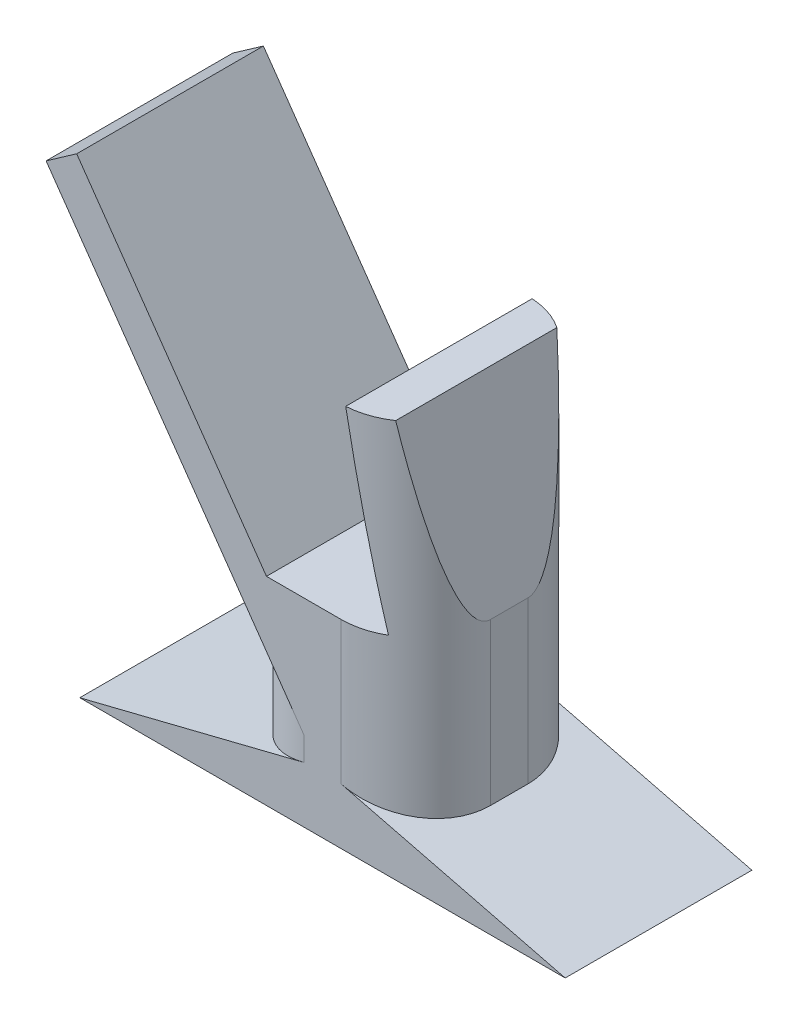
ISO-10303-21;
HEADER;
FILE_DESCRIPTION(('STEP AP214'),'2;1');
FILE_NAME('part.step','',(''),(''),'','','');
FILE_SCHEMA(('AUTOMOTIVE_DESIGN { 1 0 10303 214 1 1 1 1 }'));
ENDSEC;
DATA;
#1=APPLICATION_CONTEXT('core data for automotive mechanical design processes');
#2=APPLICATION_PROTOCOL_DEFINITION('international standard','automotive_design',2000,#1);
#3=PRODUCT_CONTEXT('',#1,'mechanical');
#4=PRODUCT('Part','Part','',(#3));
#5=PRODUCT_RELATED_PRODUCT_CATEGORY('part','',(#4));
#6=PRODUCT_DEFINITION_FORMATION('','',#4);
#7=PRODUCT_DEFINITION_CONTEXT('part definition',#1,'design');
#8=PRODUCT_DEFINITION('design','',#6,#7);
#9=PRODUCT_DEFINITION_SHAPE('','',#8);
#10=(LENGTH_UNIT() NAMED_UNIT(*) SI_UNIT(.MILLI.,.METRE.));
#11=(NAMED_UNIT(*) PLANE_ANGLE_UNIT() SI_UNIT($,.RADIAN.));
#12=(NAMED_UNIT(*) SI_UNIT($,.STERADIAN.) SOLID_ANGLE_UNIT());
#13=UNCERTAINTY_MEASURE_WITH_UNIT(LENGTH_MEASURE(1.E-05),#10,'distance_accuracy_value','');
#14=(GEOMETRIC_REPRESENTATION_CONTEXT(3) GLOBAL_UNCERTAINTY_ASSIGNED_CONTEXT((#13)) GLOBAL_UNIT_ASSIGNED_CONTEXT((#10,
#11,#12)) REPRESENTATION_CONTEXT('',''));
#15=CARTESIAN_POINT('',(0.,0.,0.));
#16=DIRECTION('',(0.,0.,1.));
#17=DIRECTION('',(1.,0.,0.));
#18=AXIS2_PLACEMENT_3D('',#15,#16,#17);
#19=CARTESIAN_POINT('',(0.,2.54,12.7));
#20=DIRECTION('',(-0.242535625036333,-0.970142500145332,0.));
#21=DIRECTION('',(0.970142500145332,-0.242535625036333,0.));
#22=AXIS2_PLACEMENT_3D('',#19,#20,#21);
#23=PLANE('',#22);
#24=DIRECTION('',(-0.970142500145332,0.242535625036333,0.));
#25=VECTOR('',#24,1.);
#26=CARTESIAN_POINT('',(0.,2.54,0.));
#27=LINE('',#26,#25);
#28=CARTESIAN_POINT('',(10.16,0.,0.));
#29=VERTEX_POINT('',#28);
#30=CARTESIAN_POINT('',(-5.08,3.81,0.));
#31=VERTEX_POINT('',#30);
#32=EDGE_CURVE('E222',#29,#31,#27,.T.);
#33=ORIENTED_EDGE('',*,*,#32,.T.);
#34=CARTESIAN_POINT('',(-5.08,3.81,5.08));
#35=DIRECTION('',(-0.242535625036333,-0.970142500145332,0.));
#36=DIRECTION('',(0.970142500145332,-0.242535625036333,0.));
#37=AXIS2_PLACEMENT_3D('',#34,#35,#36);
#38=ELLIPSE('',#37,5.23634414453443,5.08);
#39=CARTESIAN_POINT('',(0.,2.54,5.08));
#40=VERTEX_POINT('',#39);
#41=EDGE_CURVE('E42',#31,#40,#38,.T.);
#42=ORIENTED_EDGE('',*,*,#41,.T.);
#43=DIRECTION('',(0.,0.,-1.));
#44=VECTOR('',#43,1.);
#45=CARTESIAN_POINT('',(0.,2.54,12.7));
#46=LINE('',#45,#44);
#47=CARTESIAN_POINT('',(0.,2.54,7.62));
#48=VERTEX_POINT('',#47);
#49=EDGE_CURVE('E171',#48,#40,#46,.T.);
#50=ORIENTED_EDGE('',*,*,#49,.F.);
#51=CARTESIAN_POINT('',(-5.08,3.81,7.62));
#52=DIRECTION('',(-0.242535625036333,-0.970142500145332,0.));
#53=DIRECTION('',(-0.970142500145332,0.242535625036333,0.));
#54=AXIS2_PLACEMENT_3D('',#51,#52,#53);
#55=ELLIPSE('',#54,5.23634414453443,5.08);
#56=CARTESIAN_POINT('',(-5.08,3.81,12.7));
#57=VERTEX_POINT('',#56);
#58=EDGE_CURVE('E11',#48,#57,#55,.T.);
#59=ORIENTED_EDGE('',*,*,#58,.T.);
#60=DIRECTION('',(-0.970142500145332,0.242535625036333,0.));
#61=VECTOR('',#60,1.);
#62=CARTESIAN_POINT('',(0.,2.54,12.7));
#63=LINE('',#62,#61);
#64=CARTESIAN_POINT('',(10.16,0.,12.7));
#65=VERTEX_POINT('',#64);
#66=EDGE_CURVE('E147',#65,#57,#63,.T.);
#67=ORIENTED_EDGE('',*,*,#66,.F.);
#68=DIRECTION('',(0.,0.,-1.));
#69=VECTOR('',#68,1.);
#70=CARTESIAN_POINT('',(10.16,0.,12.7));
#71=LINE('',#70,#69);
#72=EDGE_CURVE('E150',#65,#29,#71,.T.);
#73=ORIENTED_EDGE('',*,*,#72,.T.);
#74=EDGE_LOOP('',(#33,#42,#50,#59,#67,#73));
#75=FACE_BOUND('',#74,.T.);
#76=ADVANCED_FACE('F33',(#75),#23,.F.);
#77=CARTESIAN_POINT('',(0.,13.5008589237526,12.7));
#78=DIRECTION('',(-1.,0.,0.));
#79=DIRECTION('',(0.,0.,1.));
#80=AXIS2_PLACEMENT_3D('',#77,#78,#79);
#81=PLANE('',#80);
#82=ORIENTED_EDGE('',*,*,#49,.T.);
#83=DIRECTION('',(0.,1.,0.));
#84=VECTOR('',#83,1.);
#85=CARTESIAN_POINT('',(0.,13.5008589237526,5.08));
#86=LINE('',#85,#84);
#87=CARTESIAN_POINT('',(0.,13.5008589237526,5.08));
#88=VERTEX_POINT('',#87);
#89=EDGE_CURVE('E194',#40,#88,#86,.T.);
#90=ORIENTED_EDGE('',*,*,#89,.T.);
#91=DIRECTION('',(0.,0.,-1.));
#92=VECTOR('',#91,1.);
#93=CARTESIAN_POINT('',(0.,13.5008589237526,12.7));
#94=LINE('',#93,#92);
#95=CARTESIAN_POINT('',(0.,13.5008589237526,7.62));
#96=VERTEX_POINT('',#95);
#97=EDGE_CURVE('E176',#96,#88,#94,.T.);
#98=ORIENTED_EDGE('',*,*,#97,.F.);
#99=DIRECTION('',(0.,1.,0.));
#100=VECTOR('',#99,1.);
#101=CARTESIAN_POINT('',(0.,13.5008589237526,7.62));
#102=LINE('',#101,#100);
#103=EDGE_CURVE('E192',#96,#48,#102,.F.);
#104=ORIENTED_EDGE('',*,*,#103,.T.);
#105=EDGE_LOOP('',(#82,#90,#98,#104));
#106=FACE_BOUND('',#105,.T.);
#107=ADVANCED_FACE('F227',(#106),#81,.F.);
#108=CARTESIAN_POINT('',(0.,13.5008589237526,12.7));
#109=DIRECTION('',(-0.984807753012208,-0.173648177666927,0.));
#110=DIRECTION('',(0.173648177666927,-0.984807753012209,0.));
#111=AXIS2_PLACEMENT_3D('',#108,#109,#110);
#112=PLANE('',#111);
#113=ORIENTED_EDGE('',*,*,#97,.T.);
#114=CARTESIAN_POINT('',(-5.08,42.3109705674111,5.08));
#115=DIRECTION('',(-0.984807753012208,-0.173648177666927,0.));
#116=DIRECTION('',(0.173648177666927,-0.984807753012209,0.));
#117=AXIS2_PLACEMENT_3D('',#114,#115,#116);
#118=ELLIPSE('',#117,29.2545540543701,5.08);
#119=CARTESIAN_POINT('',(-2.23935265499747,26.2008589237526,0.868453649628196));
#120=VERTEX_POINT('',#119);
#121=EDGE_CURVE('E199',#88,#120,#118,.F.);
#122=ORIENTED_EDGE('',*,*,#121,.T.);
#123=DIRECTION('',(0.,0.,-1.));
#124=VECTOR('',#123,1.);
#125=CARTESIAN_POINT('',(-2.23935265499747,26.2008589237526,12.7));
#126=LINE('',#125,#124);
#127=CARTESIAN_POINT('',(-2.23935265499747,26.2008589237526,11.8315463503718));
#128=VERTEX_POINT('',#127);
#129=EDGE_CURVE('E237',#128,#120,#126,.T.);
#130=ORIENTED_EDGE('',*,*,#129,.F.);
#131=CARTESIAN_POINT('',(-5.08,42.3109705674111,7.62));
#132=DIRECTION('',(-0.984807753012208,-0.173648177666927,0.));
#133=DIRECTION('',(-0.173648177666927,0.984807753012209,0.));
#134=AXIS2_PLACEMENT_3D('',#131,#132,#133);
#135=ELLIPSE('',#134,29.2545540543701,5.08);
#136=EDGE_CURVE('E197',#128,#96,#135,.F.);
#137=ORIENTED_EDGE('',*,*,#136,.T.);
#138=EDGE_LOOP('',(#113,#122,#130,#137));
#139=FACE_BOUND('',#138,.T.);
#140=ADVANCED_FACE('F236',(#139),#112,.F.);
#141=CARTESIAN_POINT('',(-2.23935265499747,26.2008589237526,12.7));
#142=DIRECTION('',(0.,-1.,0.));
#143=DIRECTION('',(0.,0.,-1.));
#144=AXIS2_PLACEMENT_3D('',#141,#142,#143);
#145=PLANE('',#144);
#146=ORIENTED_EDGE('',*,*,#129,.T.);
#147=CARTESIAN_POINT('',(-5.08,26.2008589237526,5.08));
#148=DIRECTION('',(0.,-1.,0.));
#149=DIRECTION('',(0.,0.,-1.));
#150=AXIS2_PLACEMENT_3D('',#147,#148,#149);
#151=CIRCLE('',#150,5.08);
#152=CARTESIAN_POINT('',(-4.77935265499747,26.2008589237526,0.00890434186625461));
#153=VERTEX_POINT('',#152);
#154=EDGE_CURVE('E203',#120,#153,#151,.F.);
#155=ORIENTED_EDGE('',*,*,#154,.T.);
#156=DIRECTION('',(0.,0.,-1.));
#157=VECTOR('',#156,1.);
#158=CARTESIAN_POINT('',(-4.77935265499747,26.2008589237526,12.7));
#159=LINE('',#158,#157);
#160=CARTESIAN_POINT('',(-4.77935265499747,26.2008589237526,12.6910956581337));
#161=VERTEX_POINT('',#160);
#162=EDGE_CURVE('E243',#161,#153,#159,.T.);
#163=ORIENTED_EDGE('',*,*,#162,.F.);
#164=CARTESIAN_POINT('',(-5.08,26.2008589237526,7.62));
#165=DIRECTION('',(0.,-1.,0.));
#166=DIRECTION('',(0.,0.,-1.));
#167=AXIS2_PLACEMENT_3D('',#164,#165,#166);
#168=CIRCLE('',#167,5.08);
#169=EDGE_CURVE('E201',#161,#128,#168,.F.);
#170=ORIENTED_EDGE('',*,*,#169,.T.);
#171=EDGE_LOOP('',(#146,#155,#163,#170));
#172=FACE_BOUND('',#171,.T.);
#173=ADVANCED_FACE('F240',(#172),#145,.F.);
#174=CARTESIAN_POINT('',(-4.77935265499747,26.2008589237526,12.7));
#175=DIRECTION('',(0.984807753012209,0.173648177666928,0.));
#176=DIRECTION('',(-0.173648177666928,0.984807753012209,0.));
#177=AXIS2_PLACEMENT_3D('',#174,#175,#176);
#178=PLANE('',#177);
#179=ORIENTED_EDGE('',*,*,#162,.T.);
#180=CARTESIAN_POINT('',(-5.08,27.9059147455818,5.08));
#181=DIRECTION('',(0.984807753012209,0.173648177666928,0.));
#182=DIRECTION('',(0.173648177666928,-0.984807753012209,0.));
#183=AXIS2_PLACEMENT_3D('',#180,#181,#182);
#184=ELLIPSE('',#183,29.2545540543701,5.08);
#185=CARTESIAN_POINT('',(-2.54,13.5008589237526,0.680590948775052));
#186=VERTEX_POINT('',#185);
#187=EDGE_CURVE('E49',#153,#186,#184,.F.);
#188=ORIENTED_EDGE('',*,*,#187,.T.);
#189=DIRECTION('',(0.,0.,-1.));
#190=VECTOR('',#189,1.);
#191=CARTESIAN_POINT('',(-2.54,13.5008589237526,12.7));
#192=LINE('',#191,#190);
#193=CARTESIAN_POINT('',(-2.54,13.5008589237526,12.0194090512249));
#194=VERTEX_POINT('',#193);
#195=EDGE_CURVE('E245',#194,#186,#192,.T.);
#196=ORIENTED_EDGE('',*,*,#195,.F.);
#197=CARTESIAN_POINT('',(-5.08,27.9059147455818,7.62));
#198=DIRECTION('',(0.984807753012209,0.173648177666928,0.));
#199=DIRECTION('',(-0.173648177666928,0.984807753012209,0.));
#200=AXIS2_PLACEMENT_3D('',#197,#198,#199);
#201=ELLIPSE('',#200,29.2545540543701,5.08);
#202=EDGE_CURVE('E205',#194,#161,#201,.F.);
#203=ORIENTED_EDGE('',*,*,#202,.T.);
#204=EDGE_LOOP('',(#179,#188,#196,#203));
#205=FACE_BOUND('',#204,.T.);
#206=ADVANCED_FACE('F341',(#205),#178,.F.);
#207=CARTESIAN_POINT('',(-10.16,13.5008589237526,12.7));
#208=DIRECTION('',(0.,-1.,0.));
#209=DIRECTION('',(1.,0.,0.));
#210=AXIS2_PLACEMENT_3D('',#207,#208,#209);
#211=PLANE('',#210);
#212=CARTESIAN_POINT('',(-6.35,13.5008589237526,6.35));
#213=DIRECTION('',(0.,-1.,0.));
#214=DIRECTION('',(1.,0.,0.));
#215=AXIS2_PLACEMENT_3D('',#212,#213,#214);
#216=CIRCLE('',#215,1.27);
#217=CARTESIAN_POINT('',(-5.08,13.5008589237526,6.35));
#218=VERTEX_POINT('',#217);
#219=EDGE_CURVE('E279',#218,#218,#216,.T.);
#220=ORIENTED_EDGE('',*,*,#219,.T.);
#221=EDGE_LOOP('',(#220));
#222=FACE_BOUND('',#221,.T.);
#223=ORIENTED_EDGE('',*,*,#195,.T.);
#224=CARTESIAN_POINT('',(-5.08,13.5008589237526,5.08));
#225=DIRECTION('',(0.,-1.,0.));
#226=DIRECTION('',(1.,0.,0.));
#227=AXIS2_PLACEMENT_3D('',#224,#225,#226);
#228=CIRCLE('',#227,5.08);
#229=CARTESIAN_POINT('',(-5.08,13.5008589237526,0.));
#230=VERTEX_POINT('',#229);
#231=EDGE_CURVE('E209',#186,#230,#228,.F.);
#232=ORIENTED_EDGE('',*,*,#231,.T.);
#233=DIRECTION('',(-1.,0.,0.));
#234=VECTOR('',#233,1.);
#235=CARTESIAN_POINT('',(-10.16,13.5008589237526,0.));
#236=LINE('',#235,#234);
#237=CARTESIAN_POINT('',(-10.16,13.5008589237526,0.));
#238=VERTEX_POINT('',#237);
#239=EDGE_CURVE('E276',#230,#238,#236,.T.);
#240=ORIENTED_EDGE('',*,*,#239,.T.);
#241=DIRECTION('',(0.,0.,-1.));
#242=VECTOR('',#241,1.);
#243=CARTESIAN_POINT('',(-10.16,13.5008589237526,12.7));
#244=LINE('',#243,#242);
#245=CARTESIAN_POINT('',(-10.16,13.5008589237526,12.7));
#246=VERTEX_POINT('',#245);
#247=EDGE_CURVE('E249',#246,#238,#244,.T.);
#248=ORIENTED_EDGE('',*,*,#247,.F.);
#249=DIRECTION('',(-1.,0.,0.));
#250=VECTOR('',#249,1.);
#251=CARTESIAN_POINT('',(-10.16,13.5008589237526,12.7));
#252=LINE('',#251,#250);
#253=CARTESIAN_POINT('',(-5.08,13.5008589237526,12.7));
#254=VERTEX_POINT('',#253);
#255=EDGE_CURVE('E156',#254,#246,#252,.T.);
#256=ORIENTED_EDGE('',*,*,#255,.F.);
#257=CARTESIAN_POINT('',(-5.08,13.5008589237526,7.62));
#258=DIRECTION('',(0.,-1.,0.));
#259=DIRECTION('',(1.,0.,0.));
#260=AXIS2_PLACEMENT_3D('',#257,#258,#259);
#261=CIRCLE('',#260,5.08);
#262=EDGE_CURVE('E56',#254,#194,#261,.F.);
#263=ORIENTED_EDGE('',*,*,#262,.T.);
#264=EDGE_LOOP('',(#223,#232,#240,#248,#256,#263));
#265=FACE_BOUND('',#264,.T.);
#266=ADVANCED_FACE('F335',(#222,#265),#211,.F.);
#267=CARTESIAN_POINT('',(-10.16,13.5008589237526,12.7));
#268=DIRECTION('',(-0.819152044288991,-0.573576436351047,0.));
#269=DIRECTION('',(0.573576436351047,-0.819152044288991,0.));
#270=AXIS2_PLACEMENT_3D('',#267,#268,#269);
#271=PLANE('',#270);
#272=DIRECTION('',(-0.573576436351047,0.819152044288991,0.));
#273=VECTOR('',#272,1.);
#274=CARTESIAN_POINT('',(-10.16,13.5008589237526,0.));
#275=LINE('',#274,#273);
#276=CARTESIAN_POINT('',(-23.0690438368746,31.9368841483317,0.));
#277=VERTEX_POINT('',#276);
#278=EDGE_CURVE('E274',#238,#277,#275,.T.);
#279=ORIENTED_EDGE('',*,*,#278,.T.);
#280=DIRECTION('',(0.,0.,-1.));
#281=VECTOR('',#280,1.);
#282=CARTESIAN_POINT('',(-23.0690438368746,31.9368841483317,12.7));
#283=LINE('',#282,#281);
#284=CARTESIAN_POINT('',(-23.0690438368746,31.9368841483317,12.7));
#285=VERTEX_POINT('',#284);
#286=EDGE_CURVE('E252',#285,#277,#283,.T.);
#287=ORIENTED_EDGE('',*,*,#286,.F.);
#288=DIRECTION('',(-0.573576436351047,0.819152044288991,0.));
#289=VECTOR('',#288,1.);
#290=CARTESIAN_POINT('',(-10.16,13.5008589237526,12.7));
#291=LINE('',#290,#289);
#292=EDGE_CURVE('E285',#246,#285,#291,.T.);
#293=ORIENTED_EDGE('',*,*,#292,.F.);
#294=ORIENTED_EDGE('',*,*,#247,.T.);
#295=EDGE_LOOP('',(#279,#287,#293,#294));
#296=FACE_BOUND('',#295,.T.);
#297=ADVANCED_FACE('F340',(#296),#271,.F.);
#298=CARTESIAN_POINT('',(-23.0690438368746,31.9368841483317,12.7));
#299=DIRECTION('',(0.573576436351049,-0.81915204428899,0.));
#300=DIRECTION('',(0.81915204428899,0.573576436351049,0.));
#301=AXIS2_PLACEMENT_3D('',#298,#299,#300);
#302=PLANE('',#301);
#303=DIRECTION('',(-0.81915204428899,-0.573576436351049,0.));
#304=VECTOR('',#303,1.);
#305=CARTESIAN_POINT('',(-23.0690438368746,31.9368841483317,0.));
#306=LINE('',#305,#304);
#307=CARTESIAN_POINT('',(-25.1496900293687,30.48,0.));
#308=VERTEX_POINT('',#307);
#309=EDGE_CURVE('E272',#277,#308,#306,.T.);
#310=ORIENTED_EDGE('',*,*,#309,.T.);
#311=DIRECTION('',(0.,0.,-1.));
#312=VECTOR('',#311,1.);
#313=CARTESIAN_POINT('',(-25.1496900293687,30.48,12.7));
#314=LINE('',#313,#312);
#315=CARTESIAN_POINT('',(-25.1496900293687,30.48,12.7));
#316=VERTEX_POINT('',#315);
#317=EDGE_CURVE('E255',#316,#308,#314,.T.);
#318=ORIENTED_EDGE('',*,*,#317,.F.);
#319=DIRECTION('',(-0.81915204428899,-0.573576436351049,0.));
#320=VECTOR('',#319,1.);
#321=CARTESIAN_POINT('',(-23.0690438368746,31.9368841483317,12.7));
#322=LINE('',#321,#320);
#323=EDGE_CURVE('E283',#285,#316,#322,.T.);
#324=ORIENTED_EDGE('',*,*,#323,.F.);
#325=ORIENTED_EDGE('',*,*,#286,.T.);
#326=EDGE_LOOP('',(#310,#318,#324,#325));
#327=FACE_BOUND('',#326,.T.);
#328=ADVANCED_FACE('F403',(#327),#302,.F.);
#329=CARTESIAN_POINT('',(-12.7,12.7,12.7));
#330=DIRECTION('',(0.819152044288991,0.573576436351047,0.));
#331=DIRECTION('',(-0.573576436351047,0.819152044288991,0.));
#332=AXIS2_PLACEMENT_3D('',#329,#330,#331);
#333=PLANE('',#332);
#334=DIRECTION('',(0.573576436351047,-0.819152044288991,0.));
#335=VECTOR('',#334,1.);
#336=CARTESIAN_POINT('',(-12.7,12.7,0.));
#337=LINE('',#336,#335);
#338=CARTESIAN_POINT('',(-7.62,5.44500812575008,0.));
#339=VERTEX_POINT('',#338);
#340=EDGE_CURVE('E270',#308,#339,#337,.T.);
#341=ORIENTED_EDGE('',*,*,#340,.T.);
#342=CARTESIAN_POINT('',(-7.62,5.44500812575007,5.08));
#343=DIRECTION('',(0.819152044288991,0.573576436351047,0.));
#344=DIRECTION('',(-0.573576436351047,0.819152044288991,0.));
#345=AXIS2_PLACEMENT_3D('',#342,#343,#344);
#346=ELLIPSE('',#345,8.85670972175516,5.08);
#347=CARTESIAN_POINT('',(-12.7,12.7,5.08));
#348=VERTEX_POINT('',#347);
#349=EDGE_CURVE('E219',#339,#348,#346,.T.);
#350=ORIENTED_EDGE('',*,*,#349,.T.);
#351=DIRECTION('',(0.,0.,-1.));
#352=VECTOR('',#351,1.);
#353=CARTESIAN_POINT('',(-12.7,12.7,12.7));
#354=LINE('',#353,#352);
#355=CARTESIAN_POINT('',(-12.7,12.7,7.62));
#356=VERTEX_POINT('',#355);
#357=EDGE_CURVE('E258',#356,#348,#354,.T.);
#358=ORIENTED_EDGE('',*,*,#357,.F.);
#359=CARTESIAN_POINT('',(-7.62,5.44500812575007,7.62));
#360=DIRECTION('',(0.819152044288991,0.573576436351047,0.));
#361=DIRECTION('',(0.573576436351047,-0.819152044288991,0.));
#362=AXIS2_PLACEMENT_3D('',#359,#360,#361);
#363=ELLIPSE('',#362,8.85670972175516,5.08);
#364=CARTESIAN_POINT('',(-7.62,5.44500812575008,12.7));
#365=VERTEX_POINT('',#364);
#366=EDGE_CURVE('E213',#356,#365,#363,.T.);
#367=ORIENTED_EDGE('',*,*,#366,.T.);
#368=DIRECTION('',(0.573576436351047,-0.819152044288991,0.));
#369=VECTOR('',#368,1.);
#370=CARTESIAN_POINT('',(-12.7,12.7,12.7));
#371=LINE('',#370,#369);
#372=EDGE_CURVE('E281',#316,#365,#371,.T.);
#373=ORIENTED_EDGE('',*,*,#372,.F.);
#374=ORIENTED_EDGE('',*,*,#317,.T.);
#375=EDGE_LOOP('',(#341,#350,#358,#367,#373,#374));
#376=FACE_BOUND('',#375,.T.);
#377=ADVANCED_FACE('F399',(#376),#333,.F.);
#378=CARTESIAN_POINT('',(-12.7,2.54,12.7));
#379=DIRECTION('',(1.,0.,0.));
#380=DIRECTION('',(0.,0.,-1.));
#381=AXIS2_PLACEMENT_3D('',#378,#379,#380);
#382=PLANE('',#381);
#383=DIRECTION('',(0.,0.,-1.));
#384=VECTOR('',#383,1.);
#385=CARTESIAN_POINT('',(-12.7,2.54,12.7));
#386=LINE('',#385,#384);
#387=CARTESIAN_POINT('',(-12.7,2.54,7.62));
#388=VERTEX_POINT('',#387);
#389=CARTESIAN_POINT('',(-12.7,2.54,5.08));
#390=VERTEX_POINT('',#389);
#391=EDGE_CURVE('E261',#388,#390,#386,.T.);
#392=ORIENTED_EDGE('',*,*,#391,.F.);
#393=DIRECTION('',(0.,-1.,0.));
#394=VECTOR('',#393,1.);
#395=CARTESIAN_POINT('',(-12.7,2.54,7.62));
#396=LINE('',#395,#394);
#397=EDGE_CURVE('E184',#388,#356,#396,.F.);
#398=ORIENTED_EDGE('',*,*,#397,.T.);
#399=ORIENTED_EDGE('',*,*,#357,.T.);
#400=DIRECTION('',(0.,-1.,0.));
#401=VECTOR('',#400,1.);
#402=CARTESIAN_POINT('',(-12.7,2.54,5.08));
#403=LINE('',#402,#401);
#404=EDGE_CURVE('E181',#348,#390,#403,.T.);
#405=ORIENTED_EDGE('',*,*,#404,.T.);
#406=EDGE_LOOP('',(#392,#398,#399,#405));
#407=FACE_BOUND('',#406,.T.);
#408=ADVANCED_FACE('F396',(#407),#382,.F.);
#409=CARTESIAN_POINT('',(-12.7,2.54,12.7));
#410=DIRECTION('',(0.242535625036333,-0.970142500145332,0.));
#411=DIRECTION('',(0.970142500145332,0.242535625036333,0.));
#412=AXIS2_PLACEMENT_3D('',#409,#410,#411);
#413=PLANE('',#412);
#414=DIRECTION('',(-0.970142500145332,-0.242535625036333,0.));
#415=VECTOR('',#414,1.);
#416=CARTESIAN_POINT('',(-12.7,2.54,0.));
#417=LINE('',#416,#415);
#418=CARTESIAN_POINT('',(-7.62,3.81,0.));
#419=VERTEX_POINT('',#418);
#420=CARTESIAN_POINT('',(-22.86,0.,0.));
#421=VERTEX_POINT('',#420);
#422=EDGE_CURVE('E267',#419,#421,#417,.T.);
#423=ORIENTED_EDGE('',*,*,#422,.T.);
#424=DIRECTION('',(0.,0.,-1.));
#425=VECTOR('',#424,1.);
#426=CARTESIAN_POINT('',(-22.86,0.,12.7));
#427=LINE('',#426,#425);
#428=CARTESIAN_POINT('',(-22.86,0.,12.7));
#429=VERTEX_POINT('',#428);
#430=EDGE_CURVE('E264',#429,#421,#427,.T.);
#431=ORIENTED_EDGE('',*,*,#430,.F.);
#432=DIRECTION('',(-0.970142500145332,-0.242535625036333,0.));
#433=VECTOR('',#432,1.);
#434=CARTESIAN_POINT('',(-12.7,2.54,12.7));
#435=LINE('',#434,#433);
#436=CARTESIAN_POINT('',(-7.62,3.81,12.7));
#437=VERTEX_POINT('',#436);
#438=EDGE_CURVE('E162',#437,#429,#435,.T.);
#439=ORIENTED_EDGE('',*,*,#438,.F.);
#440=CARTESIAN_POINT('',(-7.62,3.81,7.62));
#441=DIRECTION('',(0.242535625036333,-0.970142500145332,0.));
#442=DIRECTION('',(-0.970142500145332,-0.242535625036333,0.));
#443=AXIS2_PLACEMENT_3D('',#440,#441,#442);
#444=ELLIPSE('',#443,5.23634414453443,5.08);
#445=EDGE_CURVE('E211',#437,#388,#444,.T.);
#446=ORIENTED_EDGE('',*,*,#445,.T.);
#447=ORIENTED_EDGE('',*,*,#391,.T.);
#448=CARTESIAN_POINT('',(-7.62,3.81,5.08));
#449=DIRECTION('',(0.242535625036333,-0.970142500145332,0.));
#450=DIRECTION('',(0.970142500145332,0.242535625036333,0.));
#451=AXIS2_PLACEMENT_3D('',#448,#449,#450);
#452=ELLIPSE('',#451,5.23634414453443,5.08);
#453=EDGE_CURVE('E216',#390,#419,#452,.T.);
#454=ORIENTED_EDGE('',*,*,#453,.T.);
#455=EDGE_LOOP('',(#423,#431,#439,#446,#447,#454));
#456=FACE_BOUND('',#455,.T.);
#457=ADVANCED_FACE('F353',(#456),#413,.F.);
#458=CARTESIAN_POINT('',(0.,0.,12.7));
#459=DIRECTION('',(0.,1.,0.));
#460=DIRECTION('',(-1.,0.,0.));
#461=AXIS2_PLACEMENT_3D('',#458,#459,#460);
#462=PLANE('',#461);
#463=CARTESIAN_POINT('',(-6.35,0.,6.35));
#464=DIRECTION('',(0.,1.,0.));
#465=DIRECTION('',(-1.,0.,0.));
#466=AXIS2_PLACEMENT_3D('',#463,#464,#465);
#467=CIRCLE('',#466,1.27);
#468=CARTESIAN_POINT('',(-7.62,0.,6.35));
#469=VERTEX_POINT('',#468);
#470=EDGE_CURVE('E37',#469,#469,#467,.T.);
#471=ORIENTED_EDGE('',*,*,#470,.T.);
#472=EDGE_LOOP('',(#471));
#473=FACE_BOUND('',#472,.T.);
#474=DIRECTION('',(1.,0.,0.));
#475=VECTOR('',#474,1.);
#476=CARTESIAN_POINT('',(0.,0.,0.));
#477=LINE('',#476,#475);
#478=EDGE_CURVE('E166',#421,#29,#477,.T.);
#479=ORIENTED_EDGE('',*,*,#478,.T.);
#480=ORIENTED_EDGE('',*,*,#72,.F.);
#481=DIRECTION('',(1.,0.,0.));
#482=VECTOR('',#481,1.);
#483=CARTESIAN_POINT('',(10.16,0.,12.7));
#484=LINE('',#483,#482);
#485=EDGE_CURVE('E157',#429,#65,#484,.T.);
#486=ORIENTED_EDGE('',*,*,#485,.F.);
#487=ORIENTED_EDGE('',*,*,#430,.T.);
#488=EDGE_LOOP('',(#479,#480,#486,#487));
#489=FACE_BOUND('',#488,.T.);
#490=ADVANCED_FACE('F168',(#473,#489),#462,.F.);
#491=CARTESIAN_POINT('',(0.,0.,12.7));
#492=DIRECTION('',(0.,0.,-1.));
#493=DIRECTION('',(-1.,0.,0.));
#494=AXIS2_PLACEMENT_3D('',#491,#492,#493);
#495=PLANE('',#494);
#496=DIRECTION('',(0.,-1.,0.));
#497=VECTOR('',#496,1.);
#498=CARTESIAN_POINT('',(-7.62,0.,12.7));
#499=LINE('',#498,#497);
#500=EDGE_CURVE('E173',#365,#437,#499,.T.);
#501=ORIENTED_EDGE('',*,*,#500,.T.);
#502=ORIENTED_EDGE('',*,*,#438,.T.);
#503=ORIENTED_EDGE('',*,*,#485,.T.);
#504=ORIENTED_EDGE('',*,*,#66,.T.);
#505=DIRECTION('',(0.,1.,0.));
#506=VECTOR('',#505,1.);
#507=CARTESIAN_POINT('',(-5.08,0.,12.7));
#508=LINE('',#507,#506);
#509=EDGE_CURVE('E170',#57,#254,#508,.T.);
#510=ORIENTED_EDGE('',*,*,#509,.T.);
#511=ORIENTED_EDGE('',*,*,#255,.T.);
#512=ORIENTED_EDGE('',*,*,#292,.T.);
#513=ORIENTED_EDGE('',*,*,#323,.T.);
#514=ORIENTED_EDGE('',*,*,#372,.T.);
#515=EDGE_LOOP('',(#501,#502,#503,#504,#510,#511,#512,#513,#514));
#516=FACE_BOUND('',#515,.T.);
#517=ADVANCED_FACE('F161',(#516),#495,.F.);
#518=CARTESIAN_POINT('',(0.,0.,0.));
#519=DIRECTION('',(0.,0.,-1.));
#520=DIRECTION('',(-1.,0.,0.));
#521=AXIS2_PLACEMENT_3D('',#518,#519,#520);
#522=PLANE('',#521);
#523=ORIENTED_EDGE('',*,*,#422,.F.);
#524=DIRECTION('',(0.,-1.,0.));
#525=VECTOR('',#524,1.);
#526=CARTESIAN_POINT('',(-7.62,12.7,0.));
#527=LINE('',#526,#525);
#528=EDGE_CURVE('E189',#419,#339,#527,.F.);
#529=ORIENTED_EDGE('',*,*,#528,.T.);
#530=ORIENTED_EDGE('',*,*,#340,.F.);
#531=ORIENTED_EDGE('',*,*,#309,.F.);
#532=ORIENTED_EDGE('',*,*,#278,.F.);
#533=ORIENTED_EDGE('',*,*,#239,.F.);
#534=DIRECTION('',(0.,1.,0.));
#535=VECTOR('',#534,1.);
#536=CARTESIAN_POINT('',(-5.08,2.54,0.));
#537=LINE('',#536,#535);
#538=EDGE_CURVE('E186',#230,#31,#537,.F.);
#539=ORIENTED_EDGE('',*,*,#538,.T.);
#540=ORIENTED_EDGE('',*,*,#32,.F.);
#541=ORIENTED_EDGE('',*,*,#478,.F.);
#542=EDGE_LOOP('',(#523,#529,#530,#531,#532,#533,#539,#540,#541));
#543=FACE_BOUND('',#542,.T.);
#544=ADVANCED_FACE('F316',(#543),#522,.T.);
#545=CARTESIAN_POINT('',(-7.62,0.,7.62));
#546=DIRECTION('',(0.,-1.,0.));
#547=DIRECTION('',(0.,0.,-1.));
#548=AXIS2_PLACEMENT_3D('',#545,#546,#547);
#549=CYLINDRICAL_SURFACE('',#548,5.08);
#550=ORIENTED_EDGE('',*,*,#366,.F.);
#551=ORIENTED_EDGE('',*,*,#397,.F.);
#552=ORIENTED_EDGE('',*,*,#445,.F.);
#553=ORIENTED_EDGE('',*,*,#500,.F.);
#554=EDGE_LOOP('',(#550,#551,#552,#553));
#555=FACE_BOUND('',#554,.T.);
#556=ADVANCED_FACE('F312',(#555),#549,.T.);
#557=CARTESIAN_POINT('',(-7.62,2.54,5.08));
#558=DIRECTION('',(0.,1.,0.));
#559=DIRECTION('',(0.,0.,1.));
#560=AXIS2_PLACEMENT_3D('',#557,#558,#559);
#561=CYLINDRICAL_SURFACE('',#560,5.08);
#562=ORIENTED_EDGE('',*,*,#349,.F.);
#563=ORIENTED_EDGE('',*,*,#528,.F.);
#564=ORIENTED_EDGE('',*,*,#453,.F.);
#565=ORIENTED_EDGE('',*,*,#404,.F.);
#566=EDGE_LOOP('',(#562,#563,#564,#565));
#567=FACE_BOUND('',#566,.T.);
#568=ADVANCED_FACE('F315',(#567),#561,.T.);
#569=CARTESIAN_POINT('',(-5.08,13.5008589237526,5.08));
#570=DIRECTION('',(0.,-1.,0.));
#571=DIRECTION('',(0.,0.,-1.));
#572=AXIS2_PLACEMENT_3D('',#569,#570,#571);
#573=CYLINDRICAL_SURFACE('',#572,5.08);
#574=ORIENTED_EDGE('',*,*,#41,.F.);
#575=ORIENTED_EDGE('',*,*,#538,.F.);
#576=ORIENTED_EDGE('',*,*,#231,.F.);
#577=ORIENTED_EDGE('',*,*,#187,.F.);
#578=ORIENTED_EDGE('',*,*,#154,.F.);
#579=ORIENTED_EDGE('',*,*,#121,.F.);
#580=ORIENTED_EDGE('',*,*,#89,.F.);
#581=EDGE_LOOP('',(#574,#575,#576,#577,#578,#579,#580));
#582=FACE_BOUND('',#581,.T.);
#583=ADVANCED_FACE('F231',(#582),#573,.T.);
#584=CARTESIAN_POINT('',(-5.08,0.,7.62));
#585=DIRECTION('',(0.,1.,0.));
#586=DIRECTION('',(0.,0.,1.));
#587=AXIS2_PLACEMENT_3D('',#584,#585,#586);
#588=CYLINDRICAL_SURFACE('',#587,5.08);
#589=ORIENTED_EDGE('',*,*,#58,.F.);
#590=ORIENTED_EDGE('',*,*,#103,.F.);
#591=ORIENTED_EDGE('',*,*,#136,.F.);
#592=ORIENTED_EDGE('',*,*,#169,.F.);
#593=ORIENTED_EDGE('',*,*,#202,.F.);
#594=ORIENTED_EDGE('',*,*,#262,.F.);
#595=ORIENTED_EDGE('',*,*,#509,.F.);
#596=EDGE_LOOP('',(#589,#590,#591,#592,#593,#594,#595));
#597=FACE_BOUND('',#596,.T.);
#598=ADVANCED_FACE('F35',(#597),#588,.T.);
#599=CARTESIAN_POINT('',(-6.35,31.9368841483317,6.35));
#600=DIRECTION('',(0.,-1.,0.));
#601=DIRECTION('',(1.,0.,0.));
#602=AXIS2_PLACEMENT_3D('',#599,#600,#601);
#603=CYLINDRICAL_SURFACE('',#602,1.27);
#604=ORIENTED_EDGE('',*,*,#470,.F.);
#605=EDGE_LOOP('',(#604));
#606=FACE_BOUND('',#605,.T.);
#607=ORIENTED_EDGE('',*,*,#219,.F.);
#608=EDGE_LOOP('',(#607));
#609=FACE_BOUND('',#608,.T.);
#610=ADVANCED_FACE('F295',(#606,#609),#603,.F.);
#611=CLOSED_SHELL('',(#76,#107,#140,#173,#206,#266,#297,#328,#377,#408,#457,#490,#517,#544,#556,
#568,#583,#598,#610));
#612=MANIFOLD_SOLID_BREP('B2',#611);
#613=ADVANCED_BREP_SHAPE_REPRESENTATION('',(#18,#612),#14);
#614=SHAPE_DEFINITION_REPRESENTATION(#9,#613);
ENDSEC;
END-ISO-10303-21;
